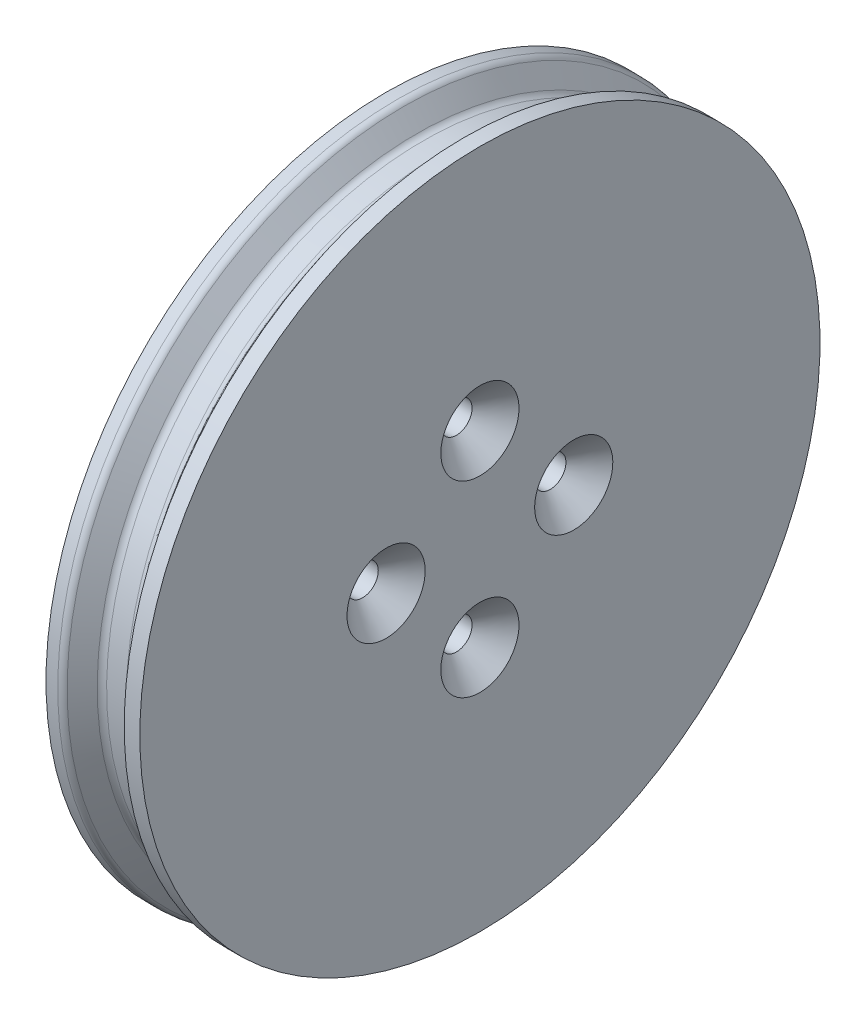
ISO-10303-21;
HEADER;
FILE_DESCRIPTION(('STEP AP214'),'2;1');
FILE_NAME('part.step','',(''),(''),'','','');
FILE_SCHEMA(('AUTOMOTIVE_DESIGN { 1 0 10303 214 1 1 1 1 }'));
ENDSEC;
DATA;
#1=APPLICATION_CONTEXT('core data for automotive mechanical design processes');
#2=APPLICATION_PROTOCOL_DEFINITION('international standard','automotive_design',2000,#1);
#3=PRODUCT_CONTEXT('',#1,'mechanical');
#4=PRODUCT('Part','Part','',(#3));
#5=PRODUCT_RELATED_PRODUCT_CATEGORY('part','',(#4));
#6=PRODUCT_DEFINITION_FORMATION('','',#4);
#7=PRODUCT_DEFINITION_CONTEXT('part definition',#1,'design');
#8=PRODUCT_DEFINITION('design','',#6,#7);
#9=PRODUCT_DEFINITION_SHAPE('','',#8);
#10=(LENGTH_UNIT() NAMED_UNIT(*) SI_UNIT(.MILLI.,.METRE.));
#11=(NAMED_UNIT(*) PLANE_ANGLE_UNIT() SI_UNIT($,.RADIAN.));
#12=(NAMED_UNIT(*) SI_UNIT($,.STERADIAN.) SOLID_ANGLE_UNIT());
#13=UNCERTAINTY_MEASURE_WITH_UNIT(LENGTH_MEASURE(1.E-05),#10,'distance_accuracy_value','');
#14=(GEOMETRIC_REPRESENTATION_CONTEXT(3) GLOBAL_UNCERTAINTY_ASSIGNED_CONTEXT((#13)) GLOBAL_UNIT_ASSIGNED_CONTEXT((#10,
#11,#12)) REPRESENTATION_CONTEXT('',''));
#15=CARTESIAN_POINT('',(0.,0.,0.));
#16=DIRECTION('',(0.,0.,1.));
#17=DIRECTION('',(1.,0.,0.));
#18=AXIS2_PLACEMENT_3D('',#15,#16,#17);
#19=CARTESIAN_POINT('',(0.,0.,0.));
#20=DIRECTION('',(1.,0.,0.));
#21=DIRECTION('',(0.,1.,0.));
#22=AXIS2_PLACEMENT_3D('',#19,#20,#21);
#23=PLANE('',#22);
#24=CARTESIAN_POINT('',(0.,6.,0.));
#25=DIRECTION('',(1.,0.,0.));
#26=DIRECTION('',(0.,1.,0.));
#27=AXIS2_PLACEMENT_3D('',#24,#25,#26);
#28=CIRCLE('',#27,1.);
#29=CARTESIAN_POINT('',(0.,7.,0.));
#30=VERTEX_POINT('',#29);
#31=EDGE_CURVE('E102',#30,#30,#28,.T.);
#32=ORIENTED_EDGE('',*,*,#31,.T.);
#33=EDGE_LOOP('',(#32));
#34=FACE_BOUND('',#33,.T.);
#35=CARTESIAN_POINT('',(0.,0.,-6.));
#36=DIRECTION('',(1.,0.,0.));
#37=DIRECTION('',(0.,1.,0.));
#38=AXIS2_PLACEMENT_3D('',#35,#36,#37);
#39=CIRCLE('',#38,0.999999999999999);
#40=CARTESIAN_POINT('',(0.,1.,-6.));
#41=VERTEX_POINT('',#40);
#42=EDGE_CURVE('E105',#41,#41,#39,.T.);
#43=ORIENTED_EDGE('',*,*,#42,.T.);
#44=EDGE_LOOP('',(#43));
#45=FACE_BOUND('',#44,.T.);
#46=CARTESIAN_POINT('',(0.,-6.,0.));
#47=DIRECTION('',(1.,0.,0.));
#48=DIRECTION('',(0.,1.,0.));
#49=AXIS2_PLACEMENT_3D('',#46,#47,#48);
#50=CIRCLE('',#49,1.);
#51=CARTESIAN_POINT('',(0.,-5.,0.));
#52=VERTEX_POINT('',#51);
#53=EDGE_CURVE('E108',#52,#52,#50,.T.);
#54=ORIENTED_EDGE('',*,*,#53,.T.);
#55=EDGE_LOOP('',(#54));
#56=FACE_BOUND('',#55,.T.);
#57=CARTESIAN_POINT('',(0.,0.,6.));
#58=DIRECTION('',(1.,0.,0.));
#59=DIRECTION('',(0.,1.,0.));
#60=AXIS2_PLACEMENT_3D('',#57,#58,#59);
#61=CIRCLE('',#60,1.);
#62=CARTESIAN_POINT('',(0.,1.,6.));
#63=VERTEX_POINT('',#62);
#64=EDGE_CURVE('E111',#63,#63,#61,.T.);
#65=ORIENTED_EDGE('',*,*,#64,.T.);
#66=EDGE_LOOP('',(#65));
#67=FACE_BOUND('',#66,.T.);
#68=CARTESIAN_POINT('',(0.,0.,0.));
#69=DIRECTION('',(-1.,0.,0.));
#70=DIRECTION('',(0.,-1.,0.));
#71=AXIS2_PLACEMENT_3D('',#68,#69,#70);
#72=CIRCLE('',#71,17.3);
#73=CARTESIAN_POINT('',(0.,-17.3,0.));
#74=VERTEX_POINT('',#73);
#75=EDGE_CURVE('E87',#74,#74,#72,.T.);
#76=ORIENTED_EDGE('',*,*,#75,.T.);
#77=EDGE_LOOP('',(#76));
#78=FACE_BOUND('',#77,.T.);
#79=ADVANCED_FACE('F37',(#34,#45,#56,#67,#78),#23,.F.);
#80=CARTESIAN_POINT('',(0.,0.,0.));
#81=DIRECTION('',(-1.,0.,0.));
#82=DIRECTION('',(0.,-1.,0.));
#83=AXIS2_PLACEMENT_3D('',#80,#81,#82);
#84=CYLINDRICAL_SURFACE('',#83,17.3);
#85=ORIENTED_EDGE('',*,*,#75,.F.);
#86=EDGE_LOOP('',(#85));
#87=FACE_BOUND('',#86,.T.);
#88=CARTESIAN_POINT('',(-3.,0.,0.));
#89=DIRECTION('',(-1.,0.,0.));
#90=DIRECTION('',(0.,-1.,0.));
#91=AXIS2_PLACEMENT_3D('',#88,#89,#90);
#92=CIRCLE('',#91,17.3);
#93=CARTESIAN_POINT('',(-3.,-17.3,0.));
#94=VERTEX_POINT('',#93);
#95=EDGE_CURVE('E90',#94,#94,#92,.T.);
#96=ORIENTED_EDGE('',*,*,#95,.T.);
#97=EDGE_LOOP('',(#96));
#98=FACE_BOUND('',#97,.T.);
#99=ADVANCED_FACE('F134',(#87,#98),#84,.F.);
#100=CARTESIAN_POINT('',(-3.,17.3,0.));
#101=DIRECTION('',(1.,0.,0.));
#102=DIRECTION('',(0.,1.,0.));
#103=AXIS2_PLACEMENT_3D('',#100,#101,#102);
#104=PLANE('',#103);
#105=ORIENTED_EDGE('',*,*,#95,.F.);
#106=EDGE_LOOP('',(#105));
#107=FACE_BOUND('',#106,.T.);
#108=CARTESIAN_POINT('',(-3.,0.,0.));
#109=DIRECTION('',(-1.,0.,0.));
#110=DIRECTION('',(0.,-1.,0.));
#111=AXIS2_PLACEMENT_3D('',#108,#109,#110);
#112=CIRCLE('',#111,21.75);
#113=CARTESIAN_POINT('',(-2.99999999999999,-21.75,0.));
#114=VERTEX_POINT('',#113);
#115=EDGE_CURVE('E93',#114,#114,#112,.T.);
#116=ORIENTED_EDGE('',*,*,#115,.T.);
#117=EDGE_LOOP('',(#116));
#118=FACE_BOUND('',#117,.T.);
#119=ADVANCED_FACE('F140',(#107,#118),#104,.F.);
#120=CARTESIAN_POINT('',(0.,0.,0.));
#121=DIRECTION('',(-1.,0.,0.));
#122=DIRECTION('',(0.,-1.,0.));
#123=AXIS2_PLACEMENT_3D('',#120,#121,#122);
#124=CYLINDRICAL_SURFACE('',#123,21.75);
#125=CARTESIAN_POINT('',(-2.25,0.,0.));
#126=DIRECTION('',(1.,0.,0.));
#127=DIRECTION('',(0.,1.,0.));
#128=AXIS2_PLACEMENT_3D('',#125,#126,#127);
#129=CIRCLE('',#128,21.75);
#130=CARTESIAN_POINT('',(-2.25,21.75,0.));
#131=VERTEX_POINT('',#130);
#132=EDGE_CURVE('E10',#131,#131,#129,.F.);
#133=ORIENTED_EDGE('',*,*,#132,.T.);
#134=EDGE_LOOP('',(#133));
#135=FACE_BOUND('',#134,.T.);
#136=ORIENTED_EDGE('',*,*,#115,.F.);
#137=EDGE_LOOP('',(#136));
#138=FACE_BOUND('',#137,.T.);
#139=ADVANCED_FACE('F200',(#135,#138),#124,.T.);
#140=CARTESIAN_POINT('',(-0.874999999999998,0.,0.));
#141=DIRECTION('',(-1.,0.,0.));
#142=DIRECTION('',(0.,-1.,0.));
#143=AXIS2_PLACEMENT_3D('',#140,#141,#142);
#144=CONICAL_SURFACE('',#143,20.25,0.927295218001613);
#145=CARTESIAN_POINT('',(-1.025,0.,0.));
#146=DIRECTION('',(-1.,0.,0.));
#147=DIRECTION('',(0.,-1.,0.));
#148=AXIS2_PLACEMENT_3D('',#145,#146,#147);
#149=CIRCLE('',#148,20.45);
#150=CARTESIAN_POINT('',(-1.02499999999999,-20.45,0.));
#151=VERTEX_POINT('',#150);
#152=EDGE_CURVE('E44',#151,#151,#149,.T.);
#153=ORIENTED_EDGE('',*,*,#152,.T.);
#154=EDGE_LOOP('',(#153));
#155=FACE_BOUND('',#154,.T.);
#156=CARTESIAN_POINT('',(-1.85,0.,0.));
#157=DIRECTION('',(1.,0.,0.));
#158=DIRECTION('',(0.,1.,0.));
#159=AXIS2_PLACEMENT_3D('',#156,#157,#158);
#160=CIRCLE('',#159,21.55);
#161=CARTESIAN_POINT('',(-1.85,21.55,0.));
#162=VERTEX_POINT('',#161);
#163=EDGE_CURVE('E48',#162,#162,#160,.T.);
#164=ORIENTED_EDGE('',*,*,#163,.T.);
#165=EDGE_LOOP('',(#164));
#166=FACE_BOUND('',#165,.T.);
#167=ADVANCED_FACE('F191',(#155,#166),#144,.T.);
#168=CARTESIAN_POINT('',(0.,0.,0.));
#169=DIRECTION('',(-1.,0.,0.));
#170=DIRECTION('',(0.,-1.,0.));
#171=AXIS2_PLACEMENT_3D('',#168,#169,#170);
#172=CYLINDRICAL_SURFACE('',#171,20.25);
#173=CARTESIAN_POINT('',(0.625,0.,0.));
#174=DIRECTION('',(-1.,0.,0.));
#175=DIRECTION('',(0.,-1.,0.));
#176=AXIS2_PLACEMENT_3D('',#173,#174,#175);
#177=CIRCLE('',#176,20.25);
#178=CARTESIAN_POINT('',(0.625000000000004,-20.25,0.));
#179=VERTEX_POINT('',#178);
#180=EDGE_CURVE('E57',#179,#179,#177,.T.);
#181=ORIENTED_EDGE('',*,*,#180,.T.);
#182=EDGE_LOOP('',(#181));
#183=FACE_BOUND('',#182,.T.);
#184=CARTESIAN_POINT('',(-0.624999999999999,0.,0.));
#185=DIRECTION('',(-1.,0.,0.));
#186=DIRECTION('',(0.,-1.,0.));
#187=AXIS2_PLACEMENT_3D('',#184,#185,#186);
#188=CIRCLE('',#187,20.25);
#189=CARTESIAN_POINT('',(-0.624999999999995,-20.25,0.));
#190=VERTEX_POINT('',#189);
#191=EDGE_CURVE('E60',#190,#190,#188,.F.);
#192=ORIENTED_EDGE('',*,*,#191,.T.);
#193=EDGE_LOOP('',(#192));
#194=FACE_BOUND('',#193,.T.);
#195=ADVANCED_FACE('F188',(#183,#194),#172,.T.);
#196=CARTESIAN_POINT('',(2.,0.,0.));
#197=DIRECTION('',(1.,0.,0.));
#198=DIRECTION('',(0.,1.,0.));
#199=AXIS2_PLACEMENT_3D('',#196,#197,#198);
#200=CONICAL_SURFACE('',#199,21.75,0.927295218001612);
#201=CARTESIAN_POINT('',(1.025,0.,0.));
#202=DIRECTION('',(1.,0.,0.));
#203=DIRECTION('',(0.,1.,0.));
#204=AXIS2_PLACEMENT_3D('',#201,#202,#203);
#205=CIRCLE('',#204,20.45);
#206=CARTESIAN_POINT('',(1.02499999999999,20.45,0.));
#207=VERTEX_POINT('',#206);
#208=EDGE_CURVE('E52',#207,#207,#205,.T.);
#209=ORIENTED_EDGE('',*,*,#208,.T.);
#210=EDGE_LOOP('',(#209));
#211=FACE_BOUND('',#210,.T.);
#212=CARTESIAN_POINT('',(2.,0.,0.));
#213=DIRECTION('',(-1.,0.,0.));
#214=DIRECTION('',(0.,-1.,0.));
#215=AXIS2_PLACEMENT_3D('',#212,#213,#214);
#216=CIRCLE('',#215,21.75);
#217=CARTESIAN_POINT('',(2.00000000000001,-21.75,0.));
#218=VERTEX_POINT('',#217);
#219=EDGE_CURVE('E96',#218,#218,#216,.T.);
#220=ORIENTED_EDGE('',*,*,#219,.T.);
#221=EDGE_LOOP('',(#220));
#222=FACE_BOUND('',#221,.T.);
#223=ADVANCED_FACE('F190',(#211,#222),#200,.T.);
#224=CARTESIAN_POINT('',(0.,0.,0.));
#225=DIRECTION('',(-1.,0.,0.));
#226=DIRECTION('',(0.,-1.,0.));
#227=AXIS2_PLACEMENT_3D('',#224,#225,#226);
#228=CYLINDRICAL_SURFACE('',#227,21.75);
#229=ORIENTED_EDGE('',*,*,#219,.F.);
#230=EDGE_LOOP('',(#229));
#231=FACE_BOUND('',#230,.T.);
#232=CARTESIAN_POINT('',(3.,0.,0.));
#233=DIRECTION('',(-1.,0.,0.));
#234=DIRECTION('',(0.,-1.,0.));
#235=AXIS2_PLACEMENT_3D('',#232,#233,#234);
#236=CIRCLE('',#235,21.75);
#237=CARTESIAN_POINT('',(3.00000000000001,-21.75,0.));
#238=VERTEX_POINT('',#237);
#239=EDGE_CURVE('E99',#238,#238,#236,.T.);
#240=ORIENTED_EDGE('',*,*,#239,.T.);
#241=EDGE_LOOP('',(#240));
#242=FACE_BOUND('',#241,.T.);
#243=ADVANCED_FACE('F130',(#231,#242),#228,.T.);
#244=CARTESIAN_POINT('',(3.,21.75,0.));
#245=DIRECTION('',(-1.,0.,0.));
#246=DIRECTION('',(0.,-1.,0.));
#247=AXIS2_PLACEMENT_3D('',#244,#245,#246);
#248=PLANE('',#247);
#249=CARTESIAN_POINT('',(3.,0.,-6.));
#250=DIRECTION('',(-1.,0.,0.));
#251=DIRECTION('',(0.,-1.,0.));
#252=AXIS2_PLACEMENT_3D('',#249,#250,#251);
#253=CIRCLE('',#252,2.50000000000001);
#254=CARTESIAN_POINT('',(3.,-2.50000000000001,-6.));
#255=VERTEX_POINT('',#254);
#256=EDGE_CURVE('E72',#255,#255,#253,.T.);
#257=ORIENTED_EDGE('',*,*,#256,.T.);
#258=EDGE_LOOP('',(#257));
#259=FACE_BOUND('',#258,.T.);
#260=CARTESIAN_POINT('',(3.,-6.,0.));
#261=DIRECTION('',(-1.,0.,0.));
#262=DIRECTION('',(0.,-1.,0.));
#263=AXIS2_PLACEMENT_3D('',#260,#261,#262);
#264=CIRCLE('',#263,2.50000000000001);
#265=CARTESIAN_POINT('',(3.,-8.50000000000001,0.));
#266=VERTEX_POINT('',#265);
#267=EDGE_CURVE('E75',#266,#266,#264,.T.);
#268=ORIENTED_EDGE('',*,*,#267,.T.);
#269=EDGE_LOOP('',(#268));
#270=FACE_BOUND('',#269,.T.);
#271=CARTESIAN_POINT('',(3.,0.,6.));
#272=DIRECTION('',(-1.,0.,0.));
#273=DIRECTION('',(0.,-1.,0.));
#274=AXIS2_PLACEMENT_3D('',#271,#272,#273);
#275=CIRCLE('',#274,2.50000000000001);
#276=CARTESIAN_POINT('',(3.,-2.50000000000001,6.));
#277=VERTEX_POINT('',#276);
#278=EDGE_CURVE('E78',#277,#277,#275,.T.);
#279=ORIENTED_EDGE('',*,*,#278,.T.);
#280=EDGE_LOOP('',(#279));
#281=FACE_BOUND('',#280,.T.);
#282=CARTESIAN_POINT('',(3.,6.,0.));
#283=DIRECTION('',(-1.,0.,0.));
#284=DIRECTION('',(0.,-1.,0.));
#285=AXIS2_PLACEMENT_3D('',#282,#283,#284);
#286=CIRCLE('',#285,2.50000000000001);
#287=CARTESIAN_POINT('',(3.,3.49999999999999,0.));
#288=VERTEX_POINT('',#287);
#289=EDGE_CURVE('E81',#288,#288,#286,.T.);
#290=ORIENTED_EDGE('',*,*,#289,.T.);
#291=EDGE_LOOP('',(#290));
#292=FACE_BOUND('',#291,.T.);
#293=ORIENTED_EDGE('',*,*,#239,.F.);
#294=EDGE_LOOP('',(#293));
#295=FACE_BOUND('',#294,.T.);
#296=ADVANCED_FACE('F120',(#259,#270,#281,#292,#295),#248,.F.);
#297=CARTESIAN_POINT('',(-7.,0.,6.));
#298=DIRECTION('',(1.,0.,0.));
#299=DIRECTION('',(0.,1.,0.));
#300=AXIS2_PLACEMENT_3D('',#297,#298,#299);
#301=CYLINDRICAL_SURFACE('',#300,1.);
#302=CARTESIAN_POINT('',(1.5,0.,6.));
#303=DIRECTION('',(-1.,0.,0.));
#304=DIRECTION('',(0.,-1.,0.));
#305=AXIS2_PLACEMENT_3D('',#302,#303,#304);
#306=CIRCLE('',#305,1.);
#307=CARTESIAN_POINT('',(1.5,-0.999999999999999,6.));
#308=VERTEX_POINT('',#307);
#309=EDGE_CURVE('E66',#308,#308,#306,.F.);
#310=ORIENTED_EDGE('',*,*,#309,.T.);
#311=EDGE_LOOP('',(#310));
#312=FACE_BOUND('',#311,.T.);
#313=ORIENTED_EDGE('',*,*,#64,.F.);
#314=EDGE_LOOP('',(#313));
#315=FACE_BOUND('',#314,.T.);
#316=ADVANCED_FACE('F117',(#312,#315),#301,.F.);
#317=CARTESIAN_POINT('',(-7.,-6.,0.));
#318=DIRECTION('',(1.,0.,0.));
#319=DIRECTION('',(0.,1.,0.));
#320=AXIS2_PLACEMENT_3D('',#317,#318,#319);
#321=CYLINDRICAL_SURFACE('',#320,1.);
#322=CARTESIAN_POINT('',(1.5,-6.,0.));
#323=DIRECTION('',(-1.,0.,0.));
#324=DIRECTION('',(0.,0.,1.));
#325=AXIS2_PLACEMENT_3D('',#322,#323,#324);
#326=CIRCLE('',#325,1.);
#327=CARTESIAN_POINT('',(1.5,-6.,1.));
#328=VERTEX_POINT('',#327);
#329=EDGE_CURVE('E69',#328,#328,#326,.F.);
#330=ORIENTED_EDGE('',*,*,#329,.T.);
#331=EDGE_LOOP('',(#330));
#332=FACE_BOUND('',#331,.T.);
#333=ORIENTED_EDGE('',*,*,#53,.F.);
#334=EDGE_LOOP('',(#333));
#335=FACE_BOUND('',#334,.T.);
#336=ADVANCED_FACE('F119',(#332,#335),#321,.F.);
#337=CARTESIAN_POINT('',(-7.,0.,-6.));
#338=DIRECTION('',(1.,0.,0.));
#339=DIRECTION('',(0.,1.,0.));
#340=AXIS2_PLACEMENT_3D('',#337,#338,#339);
#341=CYLINDRICAL_SURFACE('',#340,0.999999999999999);
#342=CARTESIAN_POINT('',(1.5,0.,-6.));
#343=DIRECTION('',(-1.,0.,0.));
#344=DIRECTION('',(0.,-1.,0.));
#345=AXIS2_PLACEMENT_3D('',#342,#343,#344);
#346=CIRCLE('',#345,0.999999999999999);
#347=CARTESIAN_POINT('',(1.5,-0.999999999999998,-6.));
#348=VERTEX_POINT('',#347);
#349=EDGE_CURVE('E84',#348,#348,#346,.F.);
#350=ORIENTED_EDGE('',*,*,#349,.T.);
#351=EDGE_LOOP('',(#350));
#352=FACE_BOUND('',#351,.T.);
#353=ORIENTED_EDGE('',*,*,#42,.F.);
#354=EDGE_LOOP('',(#353));
#355=FACE_BOUND('',#354,.T.);
#356=ADVANCED_FACE('F127',(#352,#355),#341,.F.);
#357=CARTESIAN_POINT('',(-7.,6.,0.));
#358=DIRECTION('',(1.,0.,0.));
#359=DIRECTION('',(0.,1.,0.));
#360=AXIS2_PLACEMENT_3D('',#357,#358,#359);
#361=CYLINDRICAL_SURFACE('',#360,1.);
#362=CARTESIAN_POINT('',(1.5,6.,0.));
#363=DIRECTION('',(-1.,0.,0.));
#364=DIRECTION('',(0.,0.,1.));
#365=AXIS2_PLACEMENT_3D('',#362,#363,#364);
#366=CIRCLE('',#365,1.);
#367=CARTESIAN_POINT('',(1.5,6.,1.));
#368=VERTEX_POINT('',#367);
#369=EDGE_CURVE('E63',#368,#368,#366,.F.);
#370=ORIENTED_EDGE('',*,*,#369,.T.);
#371=EDGE_LOOP('',(#370));
#372=FACE_BOUND('',#371,.T.);
#373=ORIENTED_EDGE('',*,*,#31,.F.);
#374=EDGE_LOOP('',(#373));
#375=FACE_BOUND('',#374,.T.);
#376=ADVANCED_FACE('F154',(#372,#375),#361,.F.);
#377=CARTESIAN_POINT('',(1.5,0.,-6.));
#378=DIRECTION('',(1.,0.,0.));
#379=DIRECTION('',(0.,1.,0.));
#380=AXIS2_PLACEMENT_3D('',#377,#378,#379);
#381=CONICAL_SURFACE('',#380,0.999999999999999,0.785398163397451);
#382=ORIENTED_EDGE('',*,*,#256,.F.);
#383=EDGE_LOOP('',(#382));
#384=FACE_BOUND('',#383,.T.);
#385=ORIENTED_EDGE('',*,*,#349,.F.);
#386=EDGE_LOOP('',(#385));
#387=FACE_BOUND('',#386,.T.);
#388=ADVANCED_FACE('F147',(#384,#387),#381,.F.);
#389=CARTESIAN_POINT('',(1.5,-6.,0.));
#390=DIRECTION('',(1.,0.,0.));
#391=DIRECTION('',(0.,0.,-1.));
#392=AXIS2_PLACEMENT_3D('',#389,#390,#391);
#393=CONICAL_SURFACE('',#392,1.,0.785398163397451);
#394=ORIENTED_EDGE('',*,*,#267,.F.);
#395=EDGE_LOOP('',(#394));
#396=FACE_BOUND('',#395,.T.);
#397=ORIENTED_EDGE('',*,*,#329,.F.);
#398=EDGE_LOOP('',(#397));
#399=FACE_BOUND('',#398,.T.);
#400=ADVANCED_FACE('F153',(#396,#399),#393,.F.);
#401=CARTESIAN_POINT('',(1.5,0.,6.));
#402=DIRECTION('',(1.,0.,0.));
#403=DIRECTION('',(0.,1.,0.));
#404=AXIS2_PLACEMENT_3D('',#401,#402,#403);
#405=CONICAL_SURFACE('',#404,1.,0.785398163397451);
#406=ORIENTED_EDGE('',*,*,#278,.F.);
#407=EDGE_LOOP('',(#406));
#408=FACE_BOUND('',#407,.T.);
#409=ORIENTED_EDGE('',*,*,#309,.F.);
#410=EDGE_LOOP('',(#409));
#411=FACE_BOUND('',#410,.T.);
#412=ADVANCED_FACE('F161',(#408,#411),#405,.F.);
#413=CARTESIAN_POINT('',(1.5,6.,0.));
#414=DIRECTION('',(1.,0.,0.));
#415=DIRECTION('',(0.,0.,-1.));
#416=AXIS2_PLACEMENT_3D('',#413,#414,#415);
#417=CONICAL_SURFACE('',#416,1.,0.785398163397451);
#418=ORIENTED_EDGE('',*,*,#289,.F.);
#419=EDGE_LOOP('',(#418));
#420=FACE_BOUND('',#419,.T.);
#421=ORIENTED_EDGE('',*,*,#369,.F.);
#422=EDGE_LOOP('',(#421));
#423=FACE_BOUND('',#422,.T.);
#424=ADVANCED_FACE('F168',(#420,#423),#417,.F.);
#425=CARTESIAN_POINT('',(0.625,0.,0.));
#426=DIRECTION('',(-1.,0.,0.));
#427=DIRECTION('',(0.,-1.,0.));
#428=AXIS2_PLACEMENT_3D('',#425,#426,#427);
#429=TOROIDAL_SURFACE('',#428,20.75,0.5);
#430=ORIENTED_EDGE('',*,*,#208,.F.);
#431=EDGE_LOOP('',(#430));
#432=FACE_BOUND('',#431,.T.);
#433=ORIENTED_EDGE('',*,*,#180,.F.);
#434=EDGE_LOOP('',(#433));
#435=FACE_BOUND('',#434,.T.);
#436=ADVANCED_FACE('F174',(#432,#435),#429,.F.);
#437=CARTESIAN_POINT('',(-0.624999999999999,0.,0.));
#438=DIRECTION('',(-1.,0.,0.));
#439=DIRECTION('',(0.,-1.,0.));
#440=AXIS2_PLACEMENT_3D('',#437,#438,#439);
#441=TOROIDAL_SURFACE('',#440,20.75,0.5);
#442=ORIENTED_EDGE('',*,*,#191,.F.);
#443=EDGE_LOOP('',(#442));
#444=FACE_BOUND('',#443,.T.);
#445=ORIENTED_EDGE('',*,*,#152,.F.);
#446=EDGE_LOOP('',(#445));
#447=FACE_BOUND('',#446,.T.);
#448=ADVANCED_FACE('F177',(#444,#447),#441,.F.);
#449=CARTESIAN_POINT('',(-2.25,0.,0.));
#450=DIRECTION('',(1.,0.,0.));
#451=DIRECTION('',(0.,1.,0.));
#452=AXIS2_PLACEMENT_3D('',#449,#450,#451);
#453=TOROIDAL_SURFACE('',#452,21.25,0.5);
#454=ORIENTED_EDGE('',*,*,#163,.F.);
#455=EDGE_LOOP('',(#454));
#456=FACE_BOUND('',#455,.T.);
#457=ORIENTED_EDGE('',*,*,#132,.F.);
#458=EDGE_LOOP('',(#457));
#459=FACE_BOUND('',#458,.T.);
#460=ADVANCED_FACE('F39',(#456,#459),#453,.T.);
#461=CLOSED_SHELL('',(#79,#99,#119,#139,#167,#195,#223,#243,#296,#316,#336,#356,#376,#388,#400,
#412,#424,#436,#448,#460));
#462=MANIFOLD_SOLID_BREP('B2',#461);
#463=ADVANCED_BREP_SHAPE_REPRESENTATION('',(#18,#462),#14);
#464=SHAPE_DEFINITION_REPRESENTATION(#9,#463);
ENDSEC;
END-ISO-10303-21;
